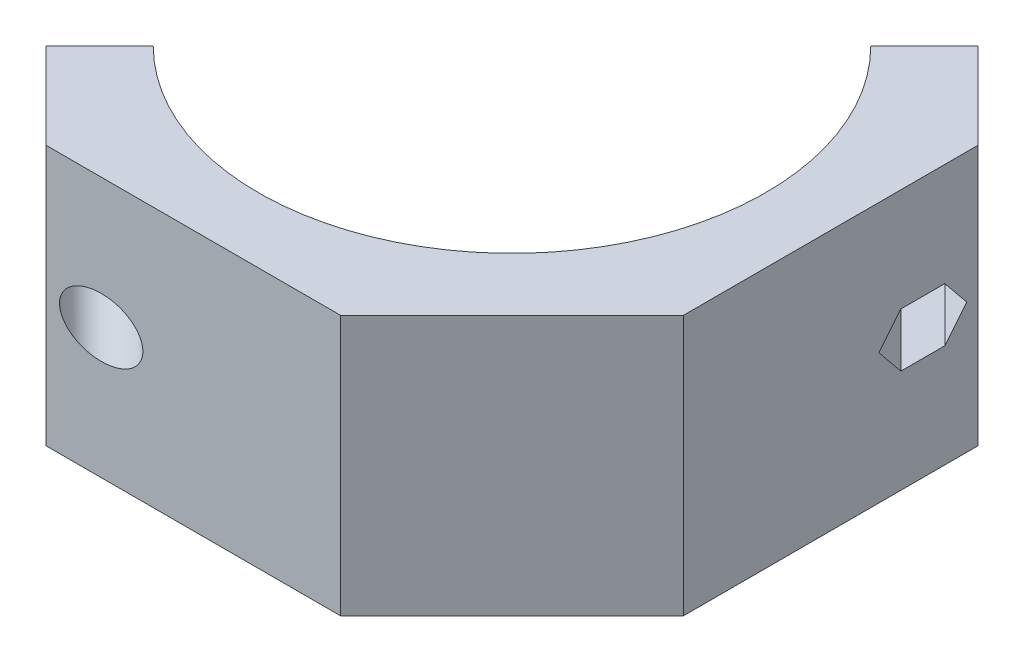
ISO-10303-21;
HEADER;
FILE_DESCRIPTION(('STEP AP214'),'2;1');
FILE_NAME('part.step','',(''),(''),'','','');
FILE_SCHEMA(('AUTOMOTIVE_DESIGN { 1 0 10303 214 1 1 1 1 }'));
ENDSEC;
DATA;
#1=APPLICATION_CONTEXT('core data for automotive mechanical design processes');
#2=APPLICATION_PROTOCOL_DEFINITION('international standard','automotive_design',2000,#1);
#3=PRODUCT_CONTEXT('',#1,'mechanical');
#4=PRODUCT('Part','Part','',(#3));
#5=PRODUCT_RELATED_PRODUCT_CATEGORY('part','',(#4));
#6=PRODUCT_DEFINITION_FORMATION('','',#4);
#7=PRODUCT_DEFINITION_CONTEXT('part definition',#1,'design');
#8=PRODUCT_DEFINITION('design','',#6,#7);
#9=PRODUCT_DEFINITION_SHAPE('','',#8);
#10=(LENGTH_UNIT() NAMED_UNIT(*) SI_UNIT(.MILLI.,.METRE.));
#11=(NAMED_UNIT(*) PLANE_ANGLE_UNIT() SI_UNIT($,.RADIAN.));
#12=(NAMED_UNIT(*) SI_UNIT($,.STERADIAN.) SOLID_ANGLE_UNIT());
#13=UNCERTAINTY_MEASURE_WITH_UNIT(LENGTH_MEASURE(1.E-05),#10,'distance_accuracy_value','');
#14=(GEOMETRIC_REPRESENTATION_CONTEXT(3) GLOBAL_UNCERTAINTY_ASSIGNED_CONTEXT((#13)) GLOBAL_UNIT_ASSIGNED_CONTEXT((#10,
#11,#12)) REPRESENTATION_CONTEXT('',''));
#15=CARTESIAN_POINT('',(0.,0.,0.));
#16=DIRECTION('',(0.,0.,1.));
#17=DIRECTION('',(1.,0.,0.));
#18=AXIS2_PLACEMENT_3D('',#15,#16,#17);
#19=CARTESIAN_POINT('',(0.,25.4,62.2173));
#20=DIRECTION('',(0.,0.,-1.));
#21=DIRECTION('',(-1.,0.,0.));
#22=AXIS2_PLACEMENT_3D('',#19,#20,#21);
#23=PLANE('',#22);
#24=CARTESIAN_POINT('',(-17.9605122421383,0.,62.2173));
#25=DIRECTION('',(0.,0.,-1.));
#26=DIRECTION('',(1.,0.,0.));
#27=AXIS2_PLACEMENT_3D('',#24,#25,#26);
#28=ELLIPSE('',#27,8.13172806425546,5.750000057);
#29=CARTESIAN_POINT('',(-9.82878417788285,0.,62.2173));
#30=VERTEX_POINT('',#29);
#31=EDGE_CURVE('E168',#30,#30,#28,.F.);
#32=ORIENTED_EDGE('',*,*,#31,.F.);
#33=EDGE_LOOP('',(#32));
#34=FACE_BOUND('',#33,.T.);
#35=DIRECTION('',(1.,0.,0.));
#36=VECTOR('',#35,1.);
#37=CARTESIAN_POINT('',(0.,-25.4,62.2173));
#38=LINE('',#37,#36);
#39=CARTESIAN_POINT('',(-28.7368195874213,-25.4,62.2173));
#40=VERTEX_POINT('',#39);
#41=CARTESIAN_POINT('',(28.7368195874213,-25.4,62.2173));
#42=VERTEX_POINT('',#41);
#43=EDGE_CURVE('E164',#40,#42,#38,.T.);
#44=ORIENTED_EDGE('',*,*,#43,.T.);
#45=DIRECTION('',(0.,-1.,0.));
#46=VECTOR('',#45,1.);
#47=CARTESIAN_POINT('',(28.7368195874213,25.4,62.2173));
#48=LINE('',#47,#46);
#49=CARTESIAN_POINT('',(28.7368195874213,25.4,62.2173));
#50=VERTEX_POINT('',#49);
#51=EDGE_CURVE('E194',#50,#42,#48,.T.);
#52=ORIENTED_EDGE('',*,*,#51,.F.);
#53=DIRECTION('',(1.,0.,0.));
#54=VECTOR('',#53,1.);
#55=CARTESIAN_POINT('',(0.,25.4,62.2173));
#56=LINE('',#55,#54);
#57=CARTESIAN_POINT('',(-28.7368195874213,25.4,62.2173));
#58=VERTEX_POINT('',#57);
#59=EDGE_CURVE('E182',#58,#50,#56,.T.);
#60=ORIENTED_EDGE('',*,*,#59,.F.);
#61=DIRECTION('',(0.,-1.,0.));
#62=VECTOR('',#61,1.);
#63=CARTESIAN_POINT('',(-28.7368195874213,25.4,62.2173));
#64=LINE('',#63,#62);
#65=EDGE_CURVE('E160',#58,#40,#64,.T.);
#66=ORIENTED_EDGE('',*,*,#65,.T.);
#67=EDGE_LOOP('',(#44,#52,#60,#66));
#68=FACE_BOUND('',#67,.T.);
#69=ADVANCED_FACE('F57',(#34,#68),#23,.F.);
#70=CARTESIAN_POINT('',(45.4770597937106,25.4,45.4770597937107));
#71=DIRECTION('',(-0.707106781186547,0.,-0.707106781186548));
#72=DIRECTION('',(-0.707106781186548,0.,0.707106781186547));
#73=AXIS2_PLACEMENT_3D('',#70,#71,#72);
#74=PLANE('',#73);
#75=DIRECTION('',(0.707106781186548,0.,-0.707106781186547));
#76=VECTOR('',#75,1.);
#77=CARTESIAN_POINT('',(45.4770597937106,-25.4,45.4770597937107));
#78=LINE('',#77,#76);
#79=CARTESIAN_POINT('',(62.2172999999999,-25.4,28.7368195874214));
#80=VERTEX_POINT('',#79);
#81=EDGE_CURVE('E167',#42,#80,#78,.T.);
#82=ORIENTED_EDGE('',*,*,#81,.T.);
#83=DIRECTION('',(0.,-1.,0.));
#84=VECTOR('',#83,1.);
#85=CARTESIAN_POINT('',(62.2172999999999,25.4,28.7368195874214));
#86=LINE('',#85,#84);
#87=CARTESIAN_POINT('',(62.2172999999999,25.4,28.7368195874214));
#88=VERTEX_POINT('',#87);
#89=EDGE_CURVE('E191',#88,#80,#86,.T.);
#90=ORIENTED_EDGE('',*,*,#89,.F.);
#91=DIRECTION('',(0.707106781186548,0.,-0.707106781186547));
#92=VECTOR('',#91,1.);
#93=CARTESIAN_POINT('',(45.4770597937106,25.4,45.4770597937107));
#94=LINE('',#93,#92);
#95=EDGE_CURVE('E122',#50,#88,#94,.T.);
#96=ORIENTED_EDGE('',*,*,#95,.F.);
#97=ORIENTED_EDGE('',*,*,#51,.T.);
#98=EDGE_LOOP('',(#82,#90,#96,#97));
#99=FACE_BOUND('',#98,.T.);
#100=ADVANCED_FACE('F295',(#99),#74,.F.);
#101=CARTESIAN_POINT('',(62.2173,25.4,0.));
#102=DIRECTION('',(-1.,0.,0.));
#103=DIRECTION('',(0.,0.,1.));
#104=AXIS2_PLACEMENT_3D('',#101,#102,#103);
#105=PLANE('',#104);
#106=DIRECTION('',(0.,0.,-1.));
#107=VECTOR('',#106,1.);
#108=CARTESIAN_POINT('',(62.2173,5.25000004099978,-1.46338138042843E-13));
#109=LINE('',#108,#107);
#110=CARTESIAN_POINT('',(62.2173,5.25000004099994,-13.6739051587916));
#111=VERTEX_POINT('',#110);
#112=CARTESIAN_POINT('',(62.2173,5.25000004100005,-22.2471193254854));
#113=VERTEX_POINT('',#112);
#114=EDGE_CURVE('E64',#111,#113,#109,.T.);
#115=ORIENTED_EDGE('',*,*,#114,.T.);
#116=DIRECTION('',(0.,-0.774596669241473,-0.632455532033689));
#117=VECTOR('',#116,1.);
#118=CARTESIAN_POINT('',(62.2173,28.2388181352498,-3.47682795196038));
#119=LINE('',#118,#117);
#120=CARTESIAN_POINT('',(62.2173,0.,-26.5337264088324));
#121=VERTEX_POINT('',#120);
#122=EDGE_CURVE('E12',#113,#121,#119,.T.);
#123=ORIENTED_EDGE('',*,*,#122,.T.);
#124=DIRECTION('',(0.,-0.774596669241497,0.632455532033659));
#125=VECTOR('',#124,1.);
#126=CARTESIAN_POINT('',(62.2173,2.24118186475065,-28.3636437386383));
#127=LINE('',#126,#125);
#128=CARTESIAN_POINT('',(62.2173,-5.25000004099995,-22.2471193254856));
#129=VERTEX_POINT('',#128);
#130=EDGE_CURVE('E196',#121,#129,#127,.T.);
#131=ORIENTED_EDGE('',*,*,#130,.T.);
#132=DIRECTION('',(0.,0.,1.));
#133=VECTOR('',#132,1.);
#134=CARTESIAN_POINT('',(62.2173,-5.25000004100021,-2.69564571510984E-13));
#135=LINE('',#134,#133);
#136=CARTESIAN_POINT('',(62.2173,-5.25000004100005,-13.6739051587919));
#137=VERTEX_POINT('',#136);
#138=EDGE_CURVE('E199',#129,#137,#135,.T.);
#139=ORIENTED_EDGE('',*,*,#138,.T.);
#140=DIRECTION('',(0.,0.774596669241474,0.632455532033687));
#141=VECTOR('',#140,1.);
#142=CARTESIAN_POINT('',(62.2173,19.8388180696497,6.81102904807194));
#143=LINE('',#142,#141);
#144=CARTESIAN_POINT('',(62.2173,-1.00577181343803E-13,-9.38729807544485));
#145=VERTEX_POINT('',#144);
#146=EDGE_CURVE('E202',#137,#145,#143,.T.);
#147=ORIENTED_EDGE('',*,*,#146,.T.);
#148=DIRECTION('',(0.,0.774596669241499,-0.632455532033657));
#149=VECTOR('',#148,1.);
#150=CARTESIAN_POINT('',(62.2173,10.6411819303505,-18.0757867386056));
#151=LINE('',#150,#149);
#152=EDGE_CURVE('E205',#145,#111,#151,.T.);
#153=ORIENTED_EDGE('',*,*,#152,.T.);
#154=EDGE_LOOP('',(#115,#123,#131,#139,#147,#153));
#155=FACE_BOUND('',#154,.T.);
#156=DIRECTION('',(0.,0.,-1.));
#157=VECTOR('',#156,1.);
#158=CARTESIAN_POINT('',(62.2173,-25.4,0.));
#159=LINE('',#158,#157);
#160=CARTESIAN_POINT('',(62.2173,-25.4,-28.7368195874213));
#161=VERTEX_POINT('',#160);
#162=EDGE_CURVE('E170',#80,#161,#159,.T.);
#163=ORIENTED_EDGE('',*,*,#162,.T.);
#164=DIRECTION('',(0.,-1.,0.));
#165=VECTOR('',#164,1.);
#166=CARTESIAN_POINT('',(62.2173,25.4,-28.7368195874213));
#167=LINE('',#166,#165);
#168=CARTESIAN_POINT('',(62.2173,25.4,-28.7368195874213));
#169=VERTEX_POINT('',#168);
#170=EDGE_CURVE('E188',#169,#161,#167,.T.);
#171=ORIENTED_EDGE('',*,*,#170,.F.);
#172=DIRECTION('',(0.,0.,-1.));
#173=VECTOR('',#172,1.);
#174=CARTESIAN_POINT('',(62.2173,25.4,0.));
#175=LINE('',#174,#173);
#176=EDGE_CURVE('E268',#88,#169,#175,.T.);
#177=ORIENTED_EDGE('',*,*,#176,.F.);
#178=ORIENTED_EDGE('',*,*,#89,.T.);
#179=EDGE_LOOP('',(#163,#171,#177,#178));
#180=FACE_BOUND('',#179,.T.);
#181=ADVANCED_FACE('F210',(#155,#180),#105,.F.);
#182=CARTESIAN_POINT('',(45.4770597937107,25.4,-45.4770597937106));
#183=DIRECTION('',(-0.707106781186548,0.,0.707106781186547));
#184=DIRECTION('',(0.707106781186547,0.,0.707106781186548));
#185=AXIS2_PLACEMENT_3D('',#182,#183,#184);
#186=PLANE('',#185);
#187=DIRECTION('',(-0.707106781186547,0.,-0.707106781186548));
#188=VECTOR('',#187,1.);
#189=CARTESIAN_POINT('',(45.4770597937107,-25.4,-45.4770597937106));
#190=LINE('',#189,#188);
#191=CARTESIAN_POINT('',(45.4770597937106,-25.4,-45.4770597937106));
#192=VERTEX_POINT('',#191);
#193=EDGE_CURVE('E172',#161,#192,#190,.T.);
#194=ORIENTED_EDGE('',*,*,#193,.T.);
#195=DIRECTION('',(0.,-1.,0.));
#196=VECTOR('',#195,1.);
#197=CARTESIAN_POINT('',(45.4770597937106,25.4,-45.4770597937106));
#198=LINE('',#197,#196);
#199=CARTESIAN_POINT('',(45.4770597937106,25.4,-45.4770597937106));
#200=VERTEX_POINT('',#199);
#201=EDGE_CURVE('E186',#200,#192,#198,.T.);
#202=ORIENTED_EDGE('',*,*,#201,.F.);
#203=DIRECTION('',(-0.707106781186547,0.,-0.707106781186548));
#204=VECTOR('',#203,1.);
#205=CARTESIAN_POINT('',(45.4770597937107,25.4,-45.4770597937106));
#206=LINE('',#205,#204);
#207=EDGE_CURVE('E270',#169,#200,#206,.T.);
#208=ORIENTED_EDGE('',*,*,#207,.F.);
#209=ORIENTED_EDGE('',*,*,#170,.T.);
#210=EDGE_LOOP('',(#194,#202,#208,#209));
#211=FACE_BOUND('',#210,.T.);
#212=ADVANCED_FACE('F363',(#211),#186,.F.);
#213=CARTESIAN_POINT('',(0.,25.4,0.));
#214=DIRECTION('',(-0.707106781186547,0.,-0.707106781186548));
#215=DIRECTION('',(-0.707106781186548,0.,0.707106781186547));
#216=AXIS2_PLACEMENT_3D('',#213,#214,#215);
#217=PLANE('',#216);
#218=CARTESIAN_POINT('',(40.0889061210692,0.,-40.0889061210692));
#219=DIRECTION('',(-0.707106781186547,0.,-0.707106781186548));
#220=DIRECTION('',(-0.707106781186548,0.,0.707106781186547));
#221=AXIS2_PLACEMENT_3D('',#218,#219,#220);
#222=CIRCLE('',#221,3.499999985);
#223=CARTESIAN_POINT('',(42.5637798446155,0.,-42.5637798446155));
#224=VERTEX_POINT('',#223);
#225=EDGE_CURVE('E252',#224,#224,#222,.F.);
#226=ORIENTED_EDGE('',*,*,#225,.T.);
#227=EDGE_LOOP('',(#226));
#228=FACE_BOUND('',#227,.T.);
#229=DIRECTION('',(0.707106781186548,0.,-0.707106781186547));
#230=VECTOR('',#229,1.);
#231=CARTESIAN_POINT('',(0.,-25.4,0.));
#232=LINE('',#231,#230);
#233=CARTESIAN_POINT('',(35.0140186160486,-25.4,-35.0140186160486));
#234=VERTEX_POINT('',#233);
#235=EDGE_CURVE('E175',#234,#192,#232,.T.);
#236=ORIENTED_EDGE('',*,*,#235,.F.);
#237=DIRECTION('',(0.,-1.,0.));
#238=VECTOR('',#237,1.);
#239=CARTESIAN_POINT('',(35.0140186160486,25.4,-35.0140186160486));
#240=LINE('',#239,#238);
#241=CARTESIAN_POINT('',(35.0140186160486,25.4,-35.0140186160486));
#242=VERTEX_POINT('',#241);
#243=EDGE_CURVE('E149',#242,#234,#240,.T.);
#244=ORIENTED_EDGE('',*,*,#243,.F.);
#245=DIRECTION('',(0.707106781186548,0.,-0.707106781186547));
#246=VECTOR('',#245,1.);
#247=CARTESIAN_POINT('',(0.,25.4,0.));
#248=LINE('',#247,#246);
#249=EDGE_CURVE('E156',#242,#200,#248,.T.);
#250=ORIENTED_EDGE('',*,*,#249,.T.);
#251=ORIENTED_EDGE('',*,*,#201,.T.);
#252=EDGE_LOOP('',(#236,#244,#250,#251));
#253=FACE_BOUND('',#252,.T.);
#254=ADVANCED_FACE('F273',(#228,#253),#217,.T.);
#255=CARTESIAN_POINT('',(0.,25.4,0.));
#256=DIRECTION('',(0.,-1.,0.));
#257=DIRECTION('',(0.,0.,-1.));
#258=AXIS2_PLACEMENT_3D('',#255,#256,#257);
#259=CYLINDRICAL_SURFACE('',#258,49.5173);
#260=CARTESIAN_POINT('',(0.,-25.4,0.));
#261=DIRECTION('',(0.,1.,0.));
#262=DIRECTION('',(0.,0.,1.));
#263=AXIS2_PLACEMENT_3D('',#260,#261,#262);
#264=CIRCLE('',#263,49.5173);
#265=CARTESIAN_POINT('',(-35.0140186160487,-25.4,35.0140186160486));
#266=VERTEX_POINT('',#265);
#267=EDGE_CURVE('E144',#266,#234,#264,.T.);
#268=ORIENTED_EDGE('',*,*,#267,.F.);
#269=DIRECTION('',(0.,-1.,0.));
#270=VECTOR('',#269,1.);
#271=CARTESIAN_POINT('',(-35.0140186160487,25.4,35.0140186160486));
#272=LINE('',#271,#270);
#273=CARTESIAN_POINT('',(-35.0140186160487,25.4,35.0140186160486));
#274=VERTEX_POINT('',#273);
#275=EDGE_CURVE('E139',#274,#266,#272,.T.);
#276=ORIENTED_EDGE('',*,*,#275,.F.);
#277=CARTESIAN_POINT('',(0.,25.4,0.));
#278=DIRECTION('',(0.,1.,0.));
#279=DIRECTION('',(0.,0.,1.));
#280=AXIS2_PLACEMENT_3D('',#277,#278,#279);
#281=CIRCLE('',#280,49.5173);
#282=EDGE_CURVE('E142',#274,#242,#281,.T.);
#283=ORIENTED_EDGE('',*,*,#282,.T.);
#284=ORIENTED_EDGE('',*,*,#243,.T.);
#285=EDGE_LOOP('',(#268,#276,#283,#284));
#286=FACE_BOUND('',#285,.T.);
#287=ADVANCED_FACE('F141',(#286),#259,.F.);
#288=CARTESIAN_POINT('',(0.,25.4,0.));
#289=DIRECTION('',(-0.707106781186547,0.,-0.707106781186548));
#290=DIRECTION('',(-0.707106781186548,0.,0.707106781186547));
#291=AXIS2_PLACEMENT_3D('',#288,#289,#290);
#292=PLANE('',#291);
#293=CARTESIAN_POINT('',(-40.0889061210692,0.,40.0889061210691));
#294=DIRECTION('',(-0.707106781186547,0.,-0.707106781186548));
#295=DIRECTION('',(-0.707106781186548,0.,0.707106781186547));
#296=AXIS2_PLACEMENT_3D('',#293,#294,#295);
#297=CIRCLE('',#296,3.499999985);
#298=CARTESIAN_POINT('',(-37.6140323975229,0.,37.6140323975228));
#299=VERTEX_POINT('',#298);
#300=EDGE_CURVE('E255',#299,#299,#297,.F.);
#301=ORIENTED_EDGE('',*,*,#300,.T.);
#302=EDGE_LOOP('',(#301));
#303=FACE_BOUND('',#302,.T.);
#304=DIRECTION('',(0.707106781186548,0.,-0.707106781186547));
#305=VECTOR('',#304,1.);
#306=CARTESIAN_POINT('',(0.,-25.4,0.));
#307=LINE('',#306,#305);
#308=CARTESIAN_POINT('',(-45.4770597937107,-25.4,45.4770597937106));
#309=VERTEX_POINT('',#308);
#310=EDGE_CURVE('E179',#309,#266,#307,.T.);
#311=ORIENTED_EDGE('',*,*,#310,.F.);
#312=DIRECTION('',(0.,-1.,0.));
#313=VECTOR('',#312,1.);
#314=CARTESIAN_POINT('',(-45.4770597937107,25.4,45.4770597937106));
#315=LINE('',#314,#313);
#316=CARTESIAN_POINT('',(-45.4770597937107,25.4,45.4770597937106));
#317=VERTEX_POINT('',#316);
#318=EDGE_CURVE('E150',#317,#309,#315,.T.);
#319=ORIENTED_EDGE('',*,*,#318,.F.);
#320=DIRECTION('',(0.707106781186548,0.,-0.707106781186547));
#321=VECTOR('',#320,1.);
#322=CARTESIAN_POINT('',(0.,25.4,0.));
#323=LINE('',#322,#321);
#324=EDGE_CURVE('E154',#317,#274,#323,.T.);
#325=ORIENTED_EDGE('',*,*,#324,.T.);
#326=ORIENTED_EDGE('',*,*,#275,.T.);
#327=EDGE_LOOP('',(#311,#319,#325,#326));
#328=FACE_BOUND('',#327,.T.);
#329=ADVANCED_FACE('F158',(#303,#328),#292,.T.);
#330=CARTESIAN_POINT('',(-45.4770597937107,25.4,45.4770597937106));
#331=DIRECTION('',(0.707106781186548,0.,-0.707106781186547));
#332=DIRECTION('',(-0.707106781186547,0.,-0.707106781186548));
#333=AXIS2_PLACEMENT_3D('',#330,#331,#332);
#334=PLANE('',#333);
#335=DIRECTION('',(0.707106781186547,0.,0.707106781186548));
#336=VECTOR('',#335,1.);
#337=CARTESIAN_POINT('',(-45.4770597937107,-25.4,45.4770597937106));
#338=LINE('',#337,#336);
#339=EDGE_CURVE('E113',#309,#40,#338,.T.);
#340=ORIENTED_EDGE('',*,*,#339,.T.);
#341=ORIENTED_EDGE('',*,*,#65,.F.);
#342=DIRECTION('',(0.707106781186547,0.,0.707106781186548));
#343=VECTOR('',#342,1.);
#344=CARTESIAN_POINT('',(-45.4770597937107,25.4,45.4770597937106));
#345=LINE('',#344,#343);
#346=EDGE_CURVE('E80',#317,#58,#345,.T.);
#347=ORIENTED_EDGE('',*,*,#346,.F.);
#348=ORIENTED_EDGE('',*,*,#318,.T.);
#349=EDGE_LOOP('',(#340,#341,#347,#348));
#350=FACE_BOUND('',#349,.T.);
#351=ADVANCED_FACE('F283',(#350),#334,.F.);
#352=CARTESIAN_POINT('',(0.,25.4,0.));
#353=DIRECTION('',(0.,1.,0.));
#354=DIRECTION('',(0.,0.,1.));
#355=AXIS2_PLACEMENT_3D('',#352,#353,#354);
#356=PLANE('',#355);
#357=ORIENTED_EDGE('',*,*,#59,.T.);
#358=ORIENTED_EDGE('',*,*,#95,.T.);
#359=ORIENTED_EDGE('',*,*,#176,.T.);
#360=ORIENTED_EDGE('',*,*,#207,.T.);
#361=ORIENTED_EDGE('',*,*,#249,.F.);
#362=ORIENTED_EDGE('',*,*,#282,.F.);
#363=ORIENTED_EDGE('',*,*,#324,.F.);
#364=ORIENTED_EDGE('',*,*,#346,.T.);
#365=EDGE_LOOP('',(#357,#358,#359,#360,#361,#362,#363,#364));
#366=FACE_BOUND('',#365,.T.);
#367=ADVANCED_FACE('F153',(#366),#356,.T.);
#368=CARTESIAN_POINT('',(0.,-25.4,0.));
#369=DIRECTION('',(0.,1.,0.));
#370=DIRECTION('',(0.,0.,1.));
#371=AXIS2_PLACEMENT_3D('',#368,#369,#370);
#372=PLANE('',#371);
#373=ORIENTED_EDGE('',*,*,#43,.F.);
#374=ORIENTED_EDGE('',*,*,#339,.F.);
#375=ORIENTED_EDGE('',*,*,#310,.T.);
#376=ORIENTED_EDGE('',*,*,#267,.T.);
#377=ORIENTED_EDGE('',*,*,#235,.T.);
#378=ORIENTED_EDGE('',*,*,#193,.F.);
#379=ORIENTED_EDGE('',*,*,#162,.F.);
#380=ORIENTED_EDGE('',*,*,#81,.F.);
#381=EDGE_LOOP('',(#373,#374,#375,#376,#377,#378,#379,#380));
#382=FACE_BOUND('',#381,.T.);
#383=ADVANCED_FACE('F278',(#382),#372,.F.);
#384=CARTESIAN_POINT('',(-37.2604789058133,0.,42.917333336325));
#385=DIRECTION('',(0.707106781186548,0.,0.707106781186547));
#386=DIRECTION('',(0.707106781186547,0.,-0.707106781186548));
#387=AXIS2_PLACEMENT_3D('',#384,#385,#386);
#388=PLANE('',#387);
#389=CARTESIAN_POINT('',(-37.2604789058133,0.,42.917333336325));
#390=DIRECTION('',(0.707106781186548,0.,0.707106781186547));
#391=DIRECTION('',(0.707106781186547,0.,-0.707106781186548));
#392=AXIS2_PLACEMENT_3D('',#389,#390,#391);
#393=CIRCLE('',#392,3.499999985);
#394=CARTESIAN_POINT('',(-34.785605182267,0.,40.4424596127787));
#395=VERTEX_POINT('',#394);
#396=EDGE_CURVE('E258',#395,#395,#393,.F.);
#397=ORIENTED_EDGE('',*,*,#396,.T.);
#398=EDGE_LOOP('',(#397));
#399=FACE_BOUND('',#398,.T.);
#400=CARTESIAN_POINT('',(-37.2604789058133,0.,42.917333336325));
#401=DIRECTION('',(0.707106781186548,0.,0.707106781186547));
#402=DIRECTION('',(0.707106781186547,0.,-0.707106781186548));
#403=AXIS2_PLACEMENT_3D('',#400,#401,#402);
#404=CIRCLE('',#403,5.750000057);
#405=CARTESIAN_POINT('',(-33.1946148736856,0.,38.8514693041973));
#406=VERTEX_POINT('',#405);
#407=EDGE_CURVE('E261',#406,#406,#404,.T.);
#408=ORIENTED_EDGE('',*,*,#407,.T.);
#409=EDGE_LOOP('',(#408));
#410=FACE_BOUND('',#409,.T.);
#411=ADVANCED_FACE('F306',(#399,#410),#388,.T.);
#412=CARTESIAN_POINT('',(-37.2604789058133,0.,42.917333336325));
#413=DIRECTION('',(0.707106781186548,0.,0.707106781186547));
#414=DIRECTION('',(0.707106781186547,0.,-0.707106781186548));
#415=AXIS2_PLACEMENT_3D('',#412,#413,#414);
#416=CYLINDRICAL_SURFACE('',#415,5.750000057);
#417=ORIENTED_EDGE('',*,*,#31,.T.);
#418=EDGE_LOOP('',(#417));
#419=FACE_BOUND('',#418,.T.);
#420=ORIENTED_EDGE('',*,*,#407,.F.);
#421=EDGE_LOOP('',(#420));
#422=FACE_BOUND('',#421,.T.);
#423=ADVANCED_FACE('F302',(#419,#422),#416,.F.);
#424=CARTESIAN_POINT('',(-40.7960129022557,0.,39.3817993398826));
#425=DIRECTION('',(0.707106781186545,0.,0.707106781186549));
#426=DIRECTION('',(0.707106781186549,0.,-0.707106781186546));
#427=AXIS2_PLACEMENT_3D('',#424,#425,#426);
#428=CYLINDRICAL_SURFACE('',#427,3.499999985);
#429=CARTESIAN_POINT('',(-37.6140323975229,0.,37.6140323975228));
#430=CARTESIAN_POINT('',(-37.5845696140306,0.,37.6434951810151));
#431=CARTESIAN_POINT('',(-37.5551068305384,0.,37.6729579645073));
#432=CARTESIAN_POINT('',(-37.4961812635539,0.,37.7318835314918));
#433=CARTESIAN_POINT('',(-37.4667184800616,0.,37.7613463149841));
#434=CARTESIAN_POINT('',(-37.4077929130771,0.,37.8202718819686));
#435=CARTESIAN_POINT('',(-37.3783301295849,0.,37.8497346654608));
#436=CARTESIAN_POINT('',(-37.3194045626004,0.,37.9086602324453));
#437=CARTESIAN_POINT('',(-37.2899417791081,0.,37.9381230159375));
#438=CARTESIAN_POINT('',(-37.2310162121236,0.,37.997048582922));
#439=CARTESIAN_POINT('',(-37.2015534286314,0.,38.0265113664143));
#440=CARTESIAN_POINT('',(-37.1426278616469,0.,38.0854369333988));
#441=CARTESIAN_POINT('',(-37.1131650781546,0.,38.114899716891));
#442=CARTESIAN_POINT('',(-37.0542395111701,0.,38.1738252838755));
#443=CARTESIAN_POINT('',(-37.0247767276779,0.,38.2032880673678));
#444=CARTESIAN_POINT('',(-36.9658511606934,0.,38.2622136343523));
#445=CARTESIAN_POINT('',(-36.9363883772012,0.,38.2916764178445));
#446=CARTESIAN_POINT('',(-36.8774628102166,0.,38.350601984829));
#447=CARTESIAN_POINT('',(-36.8480000267244,0.,38.3800647683213));
#448=CARTESIAN_POINT('',(-36.7890744597399,0.,38.4389903353058));
#449=CARTESIAN_POINT('',(-36.7596116762477,0.,38.468453118798));
#450=CARTESIAN_POINT('',(-36.7006861092632,0.,38.5273786857825));
#451=CARTESIAN_POINT('',(-36.6712233257709,0.,38.5568414692748));
#452=CARTESIAN_POINT('',(-36.6122977587864,0.,38.6157670362593));
#453=CARTESIAN_POINT('',(-36.5828349752942,0.,38.6452298197515));
#454=CARTESIAN_POINT('',(-36.5239094083097,0.,38.704155386736));
#455=CARTESIAN_POINT('',(-36.4944466248174,0.,38.7336181702283));
#456=CARTESIAN_POINT('',(-36.4355210578329,0.,38.7925437372128));
#457=CARTESIAN_POINT('',(-36.4060582743407,0.,38.822006520705));
#458=CARTESIAN_POINT('',(-36.3471327073562,0.,38.8809320876895));
#459=CARTESIAN_POINT('',(-36.3176699238639,0.,38.9103948711817));
#460=CARTESIAN_POINT('',(-36.2587443568794,0.,38.9693204381662));
#461=CARTESIAN_POINT('',(-36.2292815733872,0.,38.9987832216585));
#462=CARTESIAN_POINT('',(-36.1703560064027,0.,39.057708788643));
#463=CARTESIAN_POINT('',(-36.1408932229104,0.,39.0871715721352));
#464=CARTESIAN_POINT('',(-36.0819676559259,0.,39.1460971391197));
#465=CARTESIAN_POINT('',(-36.0525048724337,0.,39.175559922612));
#466=CARTESIAN_POINT('',(-35.9935793054492,0.,39.2344854895965));
#467=CARTESIAN_POINT('',(-35.964116521957,0.,39.2639482730887));
#468=CARTESIAN_POINT('',(-35.9051909549725,0.,39.3228738400732));
#469=CARTESIAN_POINT('',(-35.8757281714802,0.,39.3523366235655));
#470=CARTESIAN_POINT('',(-35.8168026044957,0.,39.41126219055));
#471=CARTESIAN_POINT('',(-35.7873398210035,0.,39.4407249740422));
#472=CARTESIAN_POINT('',(-35.728414254019,0.,39.4996505410267));
#473=CARTESIAN_POINT('',(-35.6989514705267,0.,39.529113324519));
#474=CARTESIAN_POINT('',(-35.6400259035422,0.,39.5880388915035));
#475=CARTESIAN_POINT('',(-35.61056312005,0.,39.6175016749957));
#476=CARTESIAN_POINT('',(-35.5516375530655,0.,39.6764272419802));
#477=CARTESIAN_POINT('',(-35.5221747695732,0.,39.7058900254725));
#478=CARTESIAN_POINT('',(-35.4632492025887,0.,39.764815592457));
#479=CARTESIAN_POINT('',(-35.4337864190965,0.,39.7942783759492));
#480=CARTESIAN_POINT('',(-35.374860852112,0.,39.8532039429337));
#481=CARTESIAN_POINT('',(-35.3453980686197,0.,39.882666726426));
#482=CARTESIAN_POINT('',(-35.2864725016352,0.,39.9415922934104));
#483=CARTESIAN_POINT('',(-35.257009718143,0.,39.9710550769027));
#484=CARTESIAN_POINT('',(-35.1980841511585,0.,40.0299806438872));
#485=CARTESIAN_POINT('',(-35.1686213676662,0.,40.0594434273794));
#486=CARTESIAN_POINT('',(-35.1096958006818,0.,40.1183689943639));
#487=CARTESIAN_POINT('',(-35.0802330171895,0.,40.1478317778562));
#488=CARTESIAN_POINT('',(-35.021307450205,0.,40.2067573448407));
#489=CARTESIAN_POINT('',(-34.9918446667128,0.,40.2362201283329));
#490=CARTESIAN_POINT('',(-34.9329190997283,0.,40.2951456953174));
#491=CARTESIAN_POINT('',(-34.903456316236,0.,40.3246084788097));
#492=CARTESIAN_POINT('',(-34.8445307492515,0.,40.3835340457942));
#493=CARTESIAN_POINT('',(-34.8150679657593,0.,40.4129968292864));
#494=CARTESIAN_POINT('',(-34.785605182267,0.,40.4424596127787));
#495=B_SPLINE_CURVE_WITH_KNOTS('',3,(#429,#430,#431,#432,#433,#434,#435,#436,#437,#438,#439,
#440,#441,#442,#443,#444,#445,#446,#447,#448,#449,#450,#451,#452,#453,#454,#455,#456,#457,#458,
#459,#460,#461,#462,#463,#464,#465,#466,#467,#468,#469,#470,#471,#472,#473,#474,#475,#476,#477,
#478,#479,#480,#481,#482,#483,#484,#485,#486,#487,#488,#489,#490,#491,#492,#493,#494),
.UNSPECIFIED.,.F.,.F.,(4,2,2,2,2,2,2,2,2,2,2,2,2,2,2,2,2,2,2,2,2,2,2,2,2,2,2,2,2,2,2,2,4),(0.,
0.125000003999997,0.250000007999998,0.375000011999995,0.500000015999996,0.625000019999997,
0.750000023999999,0.87500002799999,1.00000003199999,1.12500003599999,1.25000003999999,
1.37500004399999,1.50000004799999,1.62500005199999,1.75000005599999,1.87500005999999,
2.00000006399999,2.12500006799999,2.25000007199999,2.37500007599999,2.50000007999998,
2.62500008399999,2.75000008799999,2.87500009199999,3.00000009599999,3.12500009999999,
3.25000010399998,3.37500010799998,3.50000011199999,3.62500011599998,3.75000011999998,
3.87500012399999,4.00000012799999),.UNSPECIFIED.);
#496=EDGE_CURVE('BSEAM305',#299,#395,#495,.T.);
#497=ORIENTED_EDGE('',*,*,#300,.F.);
#498=ORIENTED_EDGE('',*,*,#396,.F.);
#499=ORIENTED_EDGE('',*,*,#496,.T.);
#500=ORIENTED_EDGE('',*,*,#496,.F.);
#501=EDGE_LOOP('',(#497,#499,#498,#500));
#502=FACE_BOUND('',#501,.T.);
#503=ADVANCED_FACE('F305',(#502),#428,.F.);
#504=CARTESIAN_POINT('',(36.5533722151394,0.,-43.6244400269989));
#505=DIRECTION('',(0.707106781186549,0.,0.707106781186545));
#506=DIRECTION('',(0.707106781186546,0.,-0.70710678118655));
#507=AXIS2_PLACEMENT_3D('',#504,#505,#506);
#508=CYLINDRICAL_SURFACE('',#507,3.499999985);
#509=CARTESIAN_POINT('',(42.917333336325,0.,-37.2604789058133));
#510=DIRECTION('',(-0.707106781186547,0.,-0.707106781186548));
#511=DIRECTION('',(-0.707106781186548,0.,0.707106781186548));
#512=AXIS2_PLACEMENT_3D('',#509,#510,#511);
#513=CIRCLE('',#512,3.499999985);
#514=CARTESIAN_POINT('',(45.3922070598713,0.,-39.7353526293596));
#515=VERTEX_POINT('',#514);
#516=EDGE_CURVE('E237',#515,#515,#513,.F.);
#517=CARTESIAN_POINT('',(45.3922070598713,0.,-39.7353526293596));
#518=CARTESIAN_POINT('',(45.3627442763791,0.,-39.7648154128519));
#519=CARTESIAN_POINT('',(45.3332814928868,0.,-39.7942781963441));
#520=CARTESIAN_POINT('',(45.2743559259023,0.,-39.8532037633286));
#521=CARTESIAN_POINT('',(45.2448931424101,0.,-39.8826665468209));
#522=CARTESIAN_POINT('',(45.1859675754256,0.,-39.9415921138054));
#523=CARTESIAN_POINT('',(45.1565047919334,0.,-39.9710548972976));
#524=CARTESIAN_POINT('',(45.0975792249489,0.,-40.0299804642821));
#525=CARTESIAN_POINT('',(45.0681164414566,0.,-40.0594432477743));
#526=CARTESIAN_POINT('',(45.0091908744721,0.,-40.1183688147589));
#527=CARTESIAN_POINT('',(44.9797280909799,0.,-40.1478315982511));
#528=CARTESIAN_POINT('',(44.9208025239954,0.,-40.2067571652356));
#529=CARTESIAN_POINT('',(44.8913397405031,0.,-40.2362199487278));
#530=CARTESIAN_POINT('',(44.8324141735186,0.,-40.2951455157123));
#531=CARTESIAN_POINT('',(44.8029513900264,0.,-40.3246082992046));
#532=CARTESIAN_POINT('',(44.7440258230419,0.,-40.3835338661891));
#533=CARTESIAN_POINT('',(44.7145630395496,0.,-40.4129966496813));
#534=CARTESIAN_POINT('',(44.6556374725651,0.,-40.4719222166658));
#535=CARTESIAN_POINT('',(44.6261746890729,0.,-40.5013850001581));
#536=CARTESIAN_POINT('',(44.5672491220884,0.,-40.5603105671426));
#537=CARTESIAN_POINT('',(44.5377863385961,0.,-40.5897733506348));
#538=CARTESIAN_POINT('',(44.4788607716116,0.,-40.6486989176193));
#539=CARTESIAN_POINT('',(44.4493979881194,0.,-40.6781617011116));
#540=CARTESIAN_POINT('',(44.3904724211349,0.,-40.7370872680961));
#541=CARTESIAN_POINT('',(44.3610096376426,0.,-40.7665500515883));
#542=CARTESIAN_POINT('',(44.3020840706581,0.,-40.8254756185728));
#543=CARTESIAN_POINT('',(44.2726212871659,0.,-40.8549384020651));
#544=CARTESIAN_POINT('',(44.2136957201814,0.,-40.9138639690496));
#545=CARTESIAN_POINT('',(44.1842329366891,0.,-40.9433267525418));
#546=CARTESIAN_POINT('',(44.1253073697047,0.,-41.0022523195263));
#547=CARTESIAN_POINT('',(44.0958445862124,0.,-41.0317151030185));
#548=CARTESIAN_POINT('',(44.0369190192279,0.,-41.090640670003));
#549=CARTESIAN_POINT('',(44.0074562357357,0.,-41.1201034534953));
#550=CARTESIAN_POINT('',(43.9485306687512,0.,-41.1790290204798));
#551=CARTESIAN_POINT('',(43.9190678852589,0.,-41.208491803972));
#552=CARTESIAN_POINT('',(43.8601423182744,0.,-41.2674173709565));
#553=CARTESIAN_POINT('',(43.8306795347822,0.,-41.2968801544488));
#554=CARTESIAN_POINT('',(43.7717539677977,0.,-41.3558057214333));
#555=CARTESIAN_POINT('',(43.7422911843054,0.,-41.3852685049255));
#556=CARTESIAN_POINT('',(43.6833656173209,0.,-41.44419407191));
#557=CARTESIAN_POINT('',(43.6539028338287,0.,-41.4736568554023));
#558=CARTESIAN_POINT('',(43.5949772668442,0.,-41.5325824223868));
#559=CARTESIAN_POINT('',(43.5655144833519,0.,-41.562045205879));
#560=CARTESIAN_POINT('',(43.5065889163674,0.,-41.6209707728635));
#561=CARTESIAN_POINT('',(43.4771261328752,0.,-41.6504335563558));
#562=CARTESIAN_POINT('',(43.4182005658907,0.,-41.7093591233403));
#563=CARTESIAN_POINT('',(43.3887377823984,0.,-41.7388219068325));
#564=CARTESIAN_POINT('',(43.3298122154139,0.,-41.797747473817));
#565=CARTESIAN_POINT('',(43.3003494319217,0.,-41.8272102573093));
#566=CARTESIAN_POINT('',(43.2414238649372,0.,-41.8861358242938));
#567=CARTESIAN_POINT('',(43.2119610814449,0.,-41.915598607786));
#568=CARTESIAN_POINT('',(43.1530355144604,0.,-41.9745241747705));
#569=CARTESIAN_POINT('',(43.1235727309682,0.,-42.0039869582627));
#570=CARTESIAN_POINT('',(43.0646471639837,0.,-42.0629125252472));
#571=CARTESIAN_POINT('',(43.0351843804915,0.,-42.0923753087395));
#572=CARTESIAN_POINT('',(42.976258813507,0.,-42.151300875724));
#573=CARTESIAN_POINT('',(42.9467960300147,0.,-42.1807636592162));
#574=CARTESIAN_POINT('',(42.8878704630302,0.,-42.2396892262007));
#575=CARTESIAN_POINT('',(42.858407679538,0.,-42.269152009693));
#576=CARTESIAN_POINT('',(42.7994821125535,0.,-42.3280775766775));
#577=CARTESIAN_POINT('',(42.7700193290612,0.,-42.3575403601697));
#578=CARTESIAN_POINT('',(42.7110937620767,0.,-42.4164659271542));
#579=CARTESIAN_POINT('',(42.6816309785845,0.,-42.4459287106465));
#580=CARTESIAN_POINT('',(42.6227054116,0.,-42.504854277631));
#581=CARTESIAN_POINT('',(42.5932426281077,0.,-42.5343170611232));
#582=CARTESIAN_POINT('',(42.5637798446155,0.,-42.5637798446155));
#583=B_SPLINE_CURVE_WITH_KNOTS('',3,(#517,#518,#519,#520,#521,#522,#523,#524,#525,#526,#527,
#528,#529,#530,#531,#532,#533,#534,#535,#536,#537,#538,#539,#540,#541,#542,#543,#544,#545,#546,
#547,#548,#549,#550,#551,#552,#553,#554,#555,#556,#557,#558,#559,#560,#561,#562,#563,#564,#565,
#566,#567,#568,#569,#570,#571,#572,#573,#574,#575,#576,#577,#578,#579,#580,#581,#582),
.UNSPECIFIED.,.F.,.F.,(4,2,2,2,2,2,2,2,2,2,2,2,2,2,2,2,2,2,2,2,2,2,2,2,2,2,2,2,2,2,2,2,4),(0.,
0.125000003999997,0.250000007999993,0.375000011999995,0.500000015999996,0.625000019999997,
0.750000023999994,0.875000027999995,1.00000003199999,1.12500003599999,1.25000003999999,
1.37500004399999,1.50000004799999,1.62500005199999,1.75000005599999,1.87500005999999,
2.00000006399999,2.12500006799999,2.25000007199999,2.37500007599999,2.50000007999998,
2.62500008399999,2.75000008799999,2.87500009199999,3.00000009599999,3.12500009999999,
3.25000010399999,3.37500010799999,3.50000011199998,3.62500011599998,3.75000011999998,
3.87500012399999,4.00000012799999),.UNSPECIFIED.);
#584=EDGE_CURVE('BSEAM317',#515,#224,#583,.T.);
#585=ORIENTED_EDGE('',*,*,#516,.T.);
#586=ORIENTED_EDGE('',*,*,#225,.F.);
#587=ORIENTED_EDGE('',*,*,#584,.T.);
#588=ORIENTED_EDGE('',*,*,#584,.F.);
#589=EDGE_LOOP('',(#585,#587,#586,#588));
#590=FACE_BOUND('',#589,.T.);
#591=ADVANCED_FACE('F317',(#590),#508,.F.);
#592=CARTESIAN_POINT('',(2.82842721525585,0.,2.82842721525581));
#593=DIRECTION('',(-0.707106781186552,0.,-0.707106781186543));
#594=DIRECTION('',(-0.707106781186543,0.,0.707106781186552));
#595=AXIS2_PLACEMENT_3D('',#592,#593,#594);
#596=PLANE('',#595);
#597=DIRECTION('',(0.353553390593283,-0.866025403784429,-0.353553390593287));
#598=VECTOR('',#597,1.);
#599=CARTESIAN_POINT('',(45.0606368779981,5.25000004100005,-39.403782447487));
#600=LINE('',#599,#598);
#601=CARTESIAN_POINT('',(45.0606368779981,5.25000004100005,-39.403782447487));
#602=VERTEX_POINT('',#601);
#603=CARTESIAN_POINT('',(47.2039404196716,0.,-41.5470859891605));
#604=VERTEX_POINT('',#603);
#605=EDGE_CURVE('E357',#602,#604,#600,.T.);
#606=ORIENTED_EDGE('',*,*,#605,.F.);
#607=DIRECTION('',(0.707106781186542,0.,-0.707106781186553));
#608=VECTOR('',#607,1.);
#609=CARTESIAN_POINT('',(40.7740297946512,5.25000004099994,-35.1171753641401));
#610=LINE('',#609,#608);
#611=CARTESIAN_POINT('',(40.7740297946512,5.25000004099994,-35.1171753641401));
#612=VERTEX_POINT('',#611);
#613=EDGE_CURVE('E249',#612,#602,#610,.T.);
#614=ORIENTED_EDGE('',*,*,#613,.F.);
#615=DIRECTION('',(0.353553390593261,0.866025403784447,-0.353553390593265));
#616=VECTOR('',#615,1.);
#617=CARTESIAN_POINT('',(38.6307262529779,-1.00540401080951E-13,-32.9738718224666));
#618=LINE('',#617,#616);
#619=CARTESIAN_POINT('',(38.6307262529779,-1.00540401080951E-13,-32.9738718224666));
#620=VERTEX_POINT('',#619);
#621=EDGE_CURVE('E233',#620,#612,#618,.T.);
#622=ORIENTED_EDGE('',*,*,#621,.F.);
#623=DIRECTION('',(-0.353553390593282,0.86602540378443,0.353553390593286));
#624=VECTOR('',#623,1.);
#625=CARTESIAN_POINT('',(40.7740297946514,-5.25000004100005,-35.1171753641402));
#626=LINE('',#625,#624);
#627=CARTESIAN_POINT('',(40.7740297946514,-5.25000004100005,-35.1171753641402));
#628=VERTEX_POINT('',#627);
#629=EDGE_CURVE('E563',#628,#620,#626,.T.);
#630=ORIENTED_EDGE('',*,*,#629,.F.);
#631=DIRECTION('',(-0.707106781186542,0.,0.707106781186553));
#632=VECTOR('',#631,1.);
#633=CARTESIAN_POINT('',(45.0606368779982,-5.25000004099995,-39.4037824474871));
#634=LINE('',#633,#632);
#635=CARTESIAN_POINT('',(45.0606368779982,-5.25000004099995,-39.4037824474871));
#636=VERTEX_POINT('',#635);
#637=EDGE_CURVE('E568',#636,#628,#634,.T.);
#638=ORIENTED_EDGE('',*,*,#637,.F.);
#639=DIRECTION('',(-0.353553390593262,-0.866025403784447,0.353553390593266));
#640=VECTOR('',#639,1.);
#641=CARTESIAN_POINT('',(47.2039404196716,0.,-41.5470859891605));
#642=LINE('',#641,#640);
#643=EDGE_CURVE('E559',#604,#636,#642,.T.);
#644=ORIENTED_EDGE('',*,*,#643,.F.);
#645=EDGE_LOOP('',(#606,#614,#622,#630,#638,#644));
#646=FACE_BOUND('',#645,.T.);
#647=ORIENTED_EDGE('',*,*,#516,.F.);
#648=EDGE_LOOP('',(#647));
#649=FACE_BOUND('',#648,.T.);
#650=ADVANCED_FACE('F323',(#646,#649),#596,.F.);
#651=CARTESIAN_POINT('',(104.449509662743,5.25000004100005,19.9850903372567));
#652=DIRECTION('',(0.612372435695784,0.500000000000016,-0.612372435695792));
#653=DIRECTION('',(-0.707106781186552,0.,-0.707106781186543));
#654=AXIS2_PLACEMENT_3D('',#651,#652,#653);
#655=PLANE('',#654);
#656=DIRECTION('',(-0.707106781186552,0.,-0.707106781186543));
#657=VECTOR('',#656,1.);
#658=CARTESIAN_POINT('',(104.449509662743,5.25000004100005,19.9850903372567));
#659=LINE('',#658,#657);
#660=EDGE_CURVE('E226',#113,#602,#659,.T.);
#661=ORIENTED_EDGE('',*,*,#660,.T.);
#662=ORIENTED_EDGE('',*,*,#605,.T.);
#663=DIRECTION('',(-0.707106781186552,0.,-0.707106781186543));
#664=VECTOR('',#663,1.);
#665=CARTESIAN_POINT('',(106.592813204416,0.,17.8417867955832));
#666=LINE('',#665,#664);
#667=EDGE_CURVE('E246',#121,#604,#666,.T.);
#668=ORIENTED_EDGE('',*,*,#667,.F.);
#669=ORIENTED_EDGE('',*,*,#122,.F.);
#670=EDGE_LOOP('',(#661,#662,#668,#669));
#671=FACE_BOUND('',#670,.T.);
#672=ADVANCED_FACE('F329',(#671),#655,.F.);
#673=CARTESIAN_POINT('',(100.162902579396,5.25000004099994,24.2716974206037));
#674=DIRECTION('',(0.,1.,0.));
#675=DIRECTION('',(0.,0.,1.));
#676=AXIS2_PLACEMENT_3D('',#673,#674,#675);
#677=PLANE('',#676);
#678=DIRECTION('',(-0.707106781186552,0.,-0.707106781186543));
#679=VECTOR('',#678,1.);
#680=CARTESIAN_POINT('',(100.162902579396,5.25000004099994,24.2716974206037));
#681=LINE('',#680,#679);
#682=EDGE_CURVE('E223',#111,#612,#681,.T.);
#683=ORIENTED_EDGE('',*,*,#682,.T.);
#684=ORIENTED_EDGE('',*,*,#613,.T.);
#685=ORIENTED_EDGE('',*,*,#660,.F.);
#686=ORIENTED_EDGE('',*,*,#114,.F.);
#687=EDGE_LOOP('',(#683,#684,#685,#686));
#688=FACE_BOUND('',#687,.T.);
#689=ADVANCED_FACE('F220',(#688),#677,.F.);
#690=CARTESIAN_POINT('',(98.0195990377224,-1.00540401080951E-13,26.4150009622771));
#691=DIRECTION('',(-0.612372435695796,0.499999999999985,0.612372435695805));
#692=DIRECTION('',(0.707106781186552,0.,0.707106781186543));
#693=AXIS2_PLACEMENT_3D('',#690,#691,#692);
#694=PLANE('',#693);
#695=DIRECTION('',(-0.707106781186552,0.,-0.707106781186543));
#696=VECTOR('',#695,1.);
#697=CARTESIAN_POINT('',(98.0195990377224,-1.00540401080951E-13,26.4150009622771));
#698=LINE('',#697,#696);
#699=EDGE_CURVE('E235',#145,#620,#698,.T.);
#700=ORIENTED_EDGE('',*,*,#699,.T.);
#701=ORIENTED_EDGE('',*,*,#621,.T.);
#702=ORIENTED_EDGE('',*,*,#682,.F.);
#703=ORIENTED_EDGE('',*,*,#152,.F.);
#704=EDGE_LOOP('',(#700,#701,#702,#703));
#705=FACE_BOUND('',#704,.T.);
#706=ADVANCED_FACE('F230',(#705),#694,.F.);
#707=CARTESIAN_POINT('',(100.162902579396,-5.25000004100005,24.2716974206035));
#708=DIRECTION('',(-0.612372435695784,-0.500000000000015,0.612372435695793));
#709=DIRECTION('',(0.707106781186553,0.,0.707106781186543));
#710=AXIS2_PLACEMENT_3D('',#707,#708,#709);
#711=PLANE('',#710);
#712=DIRECTION('',(-0.707106781186552,0.,-0.707106781186543));
#713=VECTOR('',#712,1.);
#714=CARTESIAN_POINT('',(100.162902579396,-5.25000004100005,24.2716974206035));
#715=LINE('',#714,#713);
#716=EDGE_CURVE('E239',#137,#628,#715,.T.);
#717=ORIENTED_EDGE('',*,*,#716,.T.);
#718=ORIENTED_EDGE('',*,*,#629,.T.);
#719=ORIENTED_EDGE('',*,*,#699,.F.);
#720=ORIENTED_EDGE('',*,*,#146,.F.);
#721=EDGE_LOOP('',(#717,#718,#719,#720));
#722=FACE_BOUND('',#721,.T.);
#723=ADVANCED_FACE('F339',(#722),#711,.F.);
#724=CARTESIAN_POINT('',(104.449509662743,-5.25000004099995,19.9850903372566));
#725=DIRECTION('',(0.,-1.,0.));
#726=DIRECTION('',(0.,0.,-1.));
#727=AXIS2_PLACEMENT_3D('',#724,#725,#726);
#728=PLANE('',#727);
#729=DIRECTION('',(-0.707106781186552,0.,-0.707106781186543));
#730=VECTOR('',#729,1.);
#731=CARTESIAN_POINT('',(104.449509662743,-5.25000004099995,19.9850903372566));
#732=LINE('',#731,#730);
#733=EDGE_CURVE('E71',#129,#636,#732,.T.);
#734=ORIENTED_EDGE('',*,*,#733,.T.);
#735=ORIENTED_EDGE('',*,*,#637,.T.);
#736=ORIENTED_EDGE('',*,*,#716,.F.);
#737=ORIENTED_EDGE('',*,*,#138,.F.);
#738=EDGE_LOOP('',(#734,#735,#736,#737));
#739=FACE_BOUND('',#738,.T.);
#740=ADVANCED_FACE('F336',(#739),#728,.F.);
#741=CARTESIAN_POINT('',(106.592813204416,0.,17.8417867955832));
#742=DIRECTION('',(0.612372435695796,-0.499999999999986,-0.612372435695804));
#743=DIRECTION('',(-0.707106781186552,0.,-0.707106781186543));
#744=AXIS2_PLACEMENT_3D('',#741,#742,#743);
#745=PLANE('',#744);
#746=ORIENTED_EDGE('',*,*,#667,.T.);
#747=ORIENTED_EDGE('',*,*,#643,.T.);
#748=ORIENTED_EDGE('',*,*,#733,.F.);
#749=ORIENTED_EDGE('',*,*,#130,.F.);
#750=EDGE_LOOP('',(#746,#747,#748,#749));
#751=FACE_BOUND('',#750,.T.);
#752=ADVANCED_FACE('F333',(#751),#745,.F.);
#753=CLOSED_SHELL('',(#69,#100,#181,#212,#254,#287,#329,#351,#367,#383,#411,#423,#503,#591,#650,
#672,#689,#706,#723,#740,#752));
#754=MANIFOLD_SOLID_BREP('B2',#753);
#755=ADVANCED_BREP_SHAPE_REPRESENTATION('',(#18,#754),#14);
#756=SHAPE_DEFINITION_REPRESENTATION(#9,#755);
ENDSEC;
END-ISO-10303-21;
